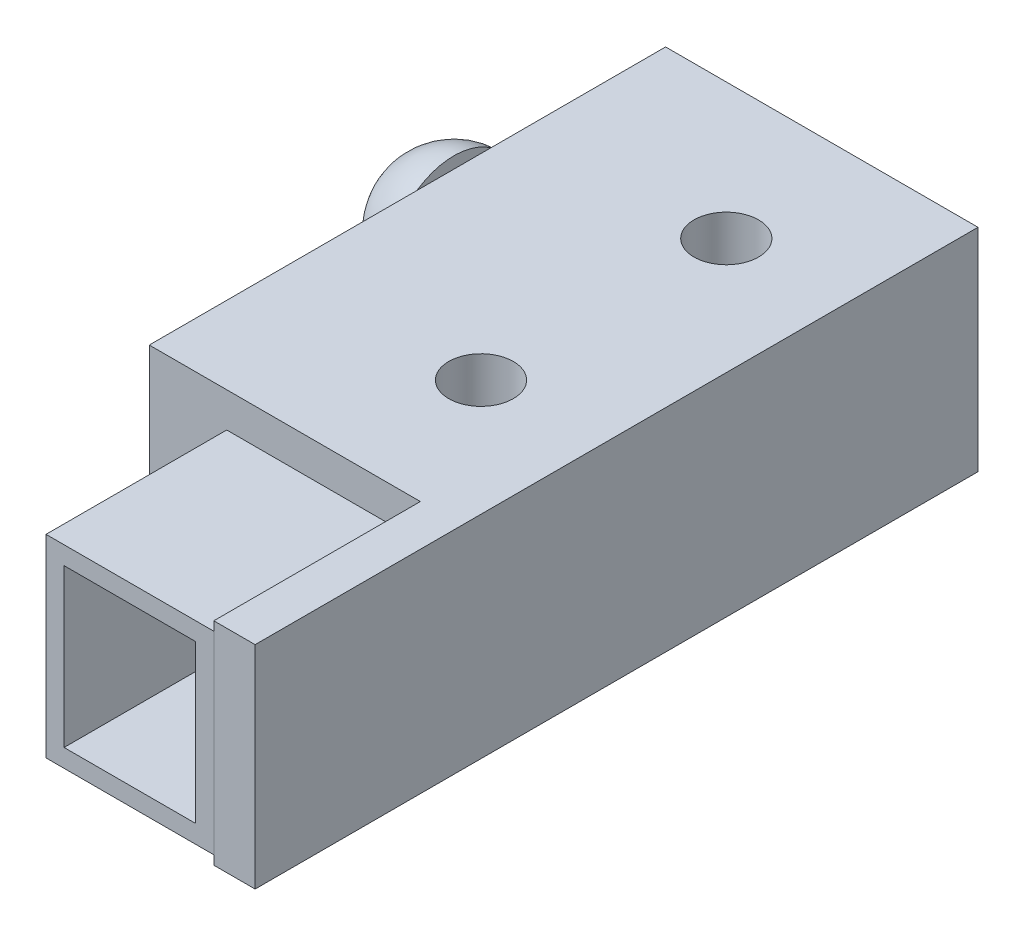
ISO-10303-21;
HEADER;
FILE_DESCRIPTION(('STEP AP214'),'2;1');
FILE_NAME('part.step','',(''),(''),'','','');
FILE_SCHEMA(('AUTOMOTIVE_DESIGN { 1 0 10303 214 1 1 1 1 }'));
ENDSEC;
DATA;
#1=APPLICATION_CONTEXT('core data for automotive mechanical design processes');
#2=APPLICATION_PROTOCOL_DEFINITION('international standard','automotive_design',2000,#1);
#3=PRODUCT_CONTEXT('',#1,'mechanical');
#4=PRODUCT('Part','Part','',(#3));
#5=PRODUCT_RELATED_PRODUCT_CATEGORY('part','',(#4));
#6=PRODUCT_DEFINITION_FORMATION('','',#4);
#7=PRODUCT_DEFINITION_CONTEXT('part definition',#1,'design');
#8=PRODUCT_DEFINITION('design','',#6,#7);
#9=PRODUCT_DEFINITION_SHAPE('','',#8);
#10=(LENGTH_UNIT() NAMED_UNIT(*) SI_UNIT(.MILLI.,.METRE.));
#11=(NAMED_UNIT(*) PLANE_ANGLE_UNIT() SI_UNIT($,.RADIAN.));
#12=(NAMED_UNIT(*) SI_UNIT($,.STERADIAN.) SOLID_ANGLE_UNIT());
#13=UNCERTAINTY_MEASURE_WITH_UNIT(LENGTH_MEASURE(1.E-05),#10,'distance_accuracy_value','');
#14=(GEOMETRIC_REPRESENTATION_CONTEXT(3) GLOBAL_UNCERTAINTY_ASSIGNED_CONTEXT((#13)) GLOBAL_UNIT_ASSIGNED_CONTEXT((#10,
#11,#12)) REPRESENTATION_CONTEXT('',''));
#15=CARTESIAN_POINT('',(0.,0.,0.));
#16=DIRECTION('',(0.,0.,1.));
#17=DIRECTION('',(1.,0.,0.));
#18=AXIS2_PLACEMENT_3D('',#15,#16,#17);
#19=CARTESIAN_POINT('',(-3.59999999999999,6.15,18.));
#20=DIRECTION('',(0.,0.,-1.));
#21=DIRECTION('',(-1.,0.,0.));
#22=AXIS2_PLACEMENT_3D('',#19,#20,#21);
#23=PLANE('',#22);
#24=DIRECTION('',(0.,1.,0.));
#25=VECTOR('',#24,1.);
#26=CARTESIAN_POINT('',(2.9,6.15,18.));
#27=LINE('',#26,#25);
#28=CARTESIAN_POINT('',(2.9,-1.35,18.));
#29=VERTEX_POINT('',#28);
#30=CARTESIAN_POINT('',(2.9,6.15,18.));
#31=VERTEX_POINT('',#30);
#32=EDGE_CURVE('E170',#29,#31,#27,.T.);
#33=ORIENTED_EDGE('',*,*,#32,.T.);
#34=DIRECTION('',(1.,0.,0.));
#35=VECTOR('',#34,1.);
#36=CARTESIAN_POINT('',(-3.59999999999999,6.15,18.));
#37=LINE('',#36,#35);
#38=CARTESIAN_POINT('',(-3.59999999999999,6.15,18.));
#39=VERTEX_POINT('',#38);
#40=EDGE_CURVE('E55',#39,#31,#37,.T.);
#41=ORIENTED_EDGE('',*,*,#40,.F.);
#42=DIRECTION('',(0.,1.,0.));
#43=VECTOR('',#42,1.);
#44=CARTESIAN_POINT('',(-3.59999999999999,6.15,18.));
#45=LINE('',#44,#43);
#46=CARTESIAN_POINT('',(-3.59999999999999,-1.35,18.));
#47=VERTEX_POINT('',#46);
#48=EDGE_CURVE('E99',#47,#39,#45,.T.);
#49=ORIENTED_EDGE('',*,*,#48,.F.);
#50=DIRECTION('',(1.,0.,0.));
#51=VECTOR('',#50,1.);
#52=CARTESIAN_POINT('',(-3.59999999999999,-1.35,18.));
#53=LINE('',#52,#51);
#54=EDGE_CURVE('E12',#47,#29,#53,.T.);
#55=ORIENTED_EDGE('',*,*,#54,.T.);
#56=EDGE_LOOP('',(#33,#41,#49,#55));
#57=FACE_BOUND('',#56,.T.);
#58=DIRECTION('',(0.,1.,0.));
#59=VECTOR('',#58,1.);
#60=CARTESIAN_POINT('',(2.20000000000001,0.,18.));
#61=LINE('',#60,#59);
#62=CARTESIAN_POINT('',(2.20000000000001,-0.650000000000003,18.));
#63=VERTEX_POINT('',#62);
#64=CARTESIAN_POINT('',(2.20000000000001,5.45,18.));
#65=VERTEX_POINT('',#64);
#66=EDGE_CURVE('E143',#63,#65,#61,.T.);
#67=ORIENTED_EDGE('',*,*,#66,.F.);
#68=DIRECTION('',(1.,0.,0.));
#69=VECTOR('',#68,1.);
#70=CARTESIAN_POINT('',(-3.59999999999999,-0.650000000000003,18.));
#71=LINE('',#70,#69);
#72=CARTESIAN_POINT('',(-2.89999999999999,-0.650000000000003,18.));
#73=VERTEX_POINT('',#72);
#74=EDGE_CURVE('E142',#73,#63,#71,.T.);
#75=ORIENTED_EDGE('',*,*,#74,.F.);
#76=DIRECTION('',(0.,1.,0.));
#77=VECTOR('',#76,1.);
#78=CARTESIAN_POINT('',(-2.89999999999999,0.,18.));
#79=LINE('',#78,#77);
#80=CARTESIAN_POINT('',(-2.89999999999999,5.45,18.));
#81=VERTEX_POINT('',#80);
#82=EDGE_CURVE('E147',#73,#81,#79,.T.);
#83=ORIENTED_EDGE('',*,*,#82,.T.);
#84=DIRECTION('',(1.,0.,0.));
#85=VECTOR('',#84,1.);
#86=CARTESIAN_POINT('',(-3.59999999999999,5.45,18.));
#87=LINE('',#86,#85);
#88=EDGE_CURVE('E152',#81,#65,#87,.T.);
#89=ORIENTED_EDGE('',*,*,#88,.T.);
#90=EDGE_LOOP('',(#67,#75,#83,#89));
#91=FACE_BOUND('',#90,.T.);
#92=ADVANCED_FACE('F47',(#57,#91),#23,.F.);
#93=CARTESIAN_POINT('',(-3.59999999999999,-1.35,18.));
#94=DIRECTION('',(0.,1.,0.));
#95=DIRECTION('',(0.,0.,1.));
#96=AXIS2_PLACEMENT_3D('',#93,#94,#95);
#97=PLANE('',#96);
#98=DIRECTION('',(0.,0.,1.));
#99=VECTOR('',#98,1.);
#100=CARTESIAN_POINT('',(2.9,-1.35,18.));
#101=LINE('',#100,#99);
#102=CARTESIAN_POINT('',(2.9,-1.35,11.));
#103=VERTEX_POINT('',#102);
#104=EDGE_CURVE('E155',#103,#29,#101,.T.);
#105=ORIENTED_EDGE('',*,*,#104,.T.);
#106=ORIENTED_EDGE('',*,*,#54,.F.);
#107=DIRECTION('',(0.,0.,1.));
#108=VECTOR('',#107,1.);
#109=CARTESIAN_POINT('',(-3.59999999999999,-1.35,18.));
#110=LINE('',#109,#108);
#111=CARTESIAN_POINT('',(-3.59999999999999,-1.35,11.));
#112=VERTEX_POINT('',#111);
#113=EDGE_CURVE('E161',#112,#47,#110,.T.);
#114=ORIENTED_EDGE('',*,*,#113,.F.);
#115=DIRECTION('',(1.,0.,0.));
#116=VECTOR('',#115,1.);
#117=CARTESIAN_POINT('',(-3.59999999999999,-1.35,11.));
#118=LINE('',#117,#116);
#119=EDGE_CURVE('E167',#112,#103,#118,.T.);
#120=ORIENTED_EDGE('',*,*,#119,.T.);
#121=EDGE_LOOP('',(#105,#106,#114,#120));
#122=FACE_BOUND('',#121,.T.);
#123=ADVANCED_FACE('F49',(#122),#97,.F.);
#124=CARTESIAN_POINT('',(-3.59999999999999,6.15,11.));
#125=DIRECTION('',(0.,-1.,0.));
#126=DIRECTION('',(0.,0.,-1.));
#127=AXIS2_PLACEMENT_3D('',#124,#125,#126);
#128=PLANE('',#127);
#129=DIRECTION('',(0.,0.,-1.));
#130=VECTOR('',#129,1.);
#131=CARTESIAN_POINT('',(2.9,6.15,11.));
#132=LINE('',#131,#130);
#133=CARTESIAN_POINT('',(2.9,6.15,11.));
#134=VERTEX_POINT('',#133);
#135=EDGE_CURVE('E172',#31,#134,#132,.T.);
#136=ORIENTED_EDGE('',*,*,#135,.T.);
#137=DIRECTION('',(1.,0.,0.));
#138=VECTOR('',#137,1.);
#139=CARTESIAN_POINT('',(-3.59999999999999,6.15,11.));
#140=LINE('',#139,#138);
#141=CARTESIAN_POINT('',(-3.59999999999999,6.15,11.));
#142=VERTEX_POINT('',#141);
#143=EDGE_CURVE('E176',#142,#134,#140,.T.);
#144=ORIENTED_EDGE('',*,*,#143,.F.);
#145=DIRECTION('',(0.,0.,-1.));
#146=VECTOR('',#145,1.);
#147=CARTESIAN_POINT('',(-3.59999999999999,6.15,11.));
#148=LINE('',#147,#146);
#149=EDGE_CURVE('E164',#39,#142,#148,.T.);
#150=ORIENTED_EDGE('',*,*,#149,.F.);
#151=ORIENTED_EDGE('',*,*,#40,.T.);
#152=EDGE_LOOP('',(#136,#144,#150,#151));
#153=FACE_BOUND('',#152,.T.);
#154=ADVANCED_FACE('F181',(#153),#128,.F.);
#155=CARTESIAN_POINT('',(-3.59999999999999,-1.35,11.));
#156=DIRECTION('',(0.,0.,1.));
#157=DIRECTION('',(1.,0.,0.));
#158=AXIS2_PLACEMENT_3D('',#155,#156,#157);
#159=PLANE('',#158);
#160=DIRECTION('',(0.,-1.,0.));
#161=VECTOR('',#160,1.);
#162=CARTESIAN_POINT('',(2.9,-1.35,11.));
#163=LINE('',#162,#161);
#164=EDGE_CURVE('E92',#134,#103,#163,.T.);
#165=ORIENTED_EDGE('',*,*,#164,.T.);
#166=ORIENTED_EDGE('',*,*,#119,.F.);
#167=DIRECTION('',(0.,-1.,0.));
#168=VECTOR('',#167,1.);
#169=CARTESIAN_POINT('',(-3.59999999999999,-1.35,11.));
#170=LINE('',#169,#168);
#171=EDGE_CURVE('E71',#142,#112,#170,.T.);
#172=ORIENTED_EDGE('',*,*,#171,.F.);
#173=ORIENTED_EDGE('',*,*,#143,.T.);
#174=EDGE_LOOP('',(#165,#166,#172,#173));
#175=FACE_BOUND('',#174,.T.);
#176=ADVANCED_FACE('F189',(#175),#159,.F.);
#177=CARTESIAN_POINT('',(-3.59999999999999,0.,0.));
#178=DIRECTION('',(1.,0.,0.));
#179=DIRECTION('',(0.,0.,-1.));
#180=AXIS2_PLACEMENT_3D('',#177,#178,#179);
#181=PLANE('',#180);
#182=ORIENTED_EDGE('',*,*,#113,.T.);
#183=ORIENTED_EDGE('',*,*,#48,.T.);
#184=ORIENTED_EDGE('',*,*,#149,.T.);
#185=ORIENTED_EDGE('',*,*,#171,.T.);
#186=EDGE_LOOP('',(#182,#183,#184,#185));
#187=FACE_BOUND('',#186,.T.);
#188=ADVANCED_FACE('F191',(#187),#181,.F.);
#189=CARTESIAN_POINT('',(2.9,0.,0.));
#190=DIRECTION('',(1.,0.,0.));
#191=DIRECTION('',(0.,0.,-1.));
#192=AXIS2_PLACEMENT_3D('',#189,#190,#191);
#193=PLANE('',#192);
#194=ORIENTED_EDGE('',*,*,#104,.F.);
#195=ORIENTED_EDGE('',*,*,#164,.F.);
#196=ORIENTED_EDGE('',*,*,#135,.F.);
#197=ORIENTED_EDGE('',*,*,#32,.F.);
#198=EDGE_LOOP('',(#194,#195,#196,#197));
#199=FACE_BOUND('',#198,.T.);
#200=ADVANCED_FACE('F185',(#199),#193,.T.);
#201=CARTESIAN_POINT('',(-3.59999999999999,-0.650000000000003,18.));
#202=DIRECTION('',(0.,1.,0.));
#203=DIRECTION('',(0.,0.,1.));
#204=AXIS2_PLACEMENT_3D('',#201,#202,#203);
#205=PLANE('',#204);
#206=DIRECTION('',(0.,0.,1.));
#207=VECTOR('',#206,1.);
#208=CARTESIAN_POINT('',(2.20000000000001,-0.650000000000003,0.));
#209=LINE('',#208,#207);
#210=CARTESIAN_POINT('',(2.20000000000001,-0.650000000000003,11.7));
#211=VERTEX_POINT('',#210);
#212=EDGE_CURVE('E126',#211,#63,#209,.T.);
#213=ORIENTED_EDGE('',*,*,#212,.F.);
#214=DIRECTION('',(1.,0.,0.));
#215=VECTOR('',#214,1.);
#216=CARTESIAN_POINT('',(-3.59999999999999,-0.650000000000003,11.7));
#217=LINE('',#216,#215);
#218=CARTESIAN_POINT('',(-2.89999999999999,-0.650000000000003,11.7));
#219=VERTEX_POINT('',#218);
#220=EDGE_CURVE('E134',#219,#211,#217,.T.);
#221=ORIENTED_EDGE('',*,*,#220,.F.);
#222=DIRECTION('',(0.,0.,1.));
#223=VECTOR('',#222,1.);
#224=CARTESIAN_POINT('',(-2.89999999999999,-0.650000000000003,0.));
#225=LINE('',#224,#223);
#226=EDGE_CURVE('E62',#219,#73,#225,.T.);
#227=ORIENTED_EDGE('',*,*,#226,.T.);
#228=ORIENTED_EDGE('',*,*,#74,.T.);
#229=EDGE_LOOP('',(#213,#221,#227,#228));
#230=FACE_BOUND('',#229,.T.);
#231=ADVANCED_FACE('F140',(#230),#205,.T.);
#232=CARTESIAN_POINT('',(-3.59999999999999,5.45,11.));
#233=DIRECTION('',(0.,-1.,0.));
#234=DIRECTION('',(0.,0.,-1.));
#235=AXIS2_PLACEMENT_3D('',#232,#233,#234);
#236=PLANE('',#235);
#237=DIRECTION('',(0.,0.,-1.));
#238=VECTOR('',#237,1.);
#239=CARTESIAN_POINT('',(2.20000000000001,5.45,0.));
#240=LINE('',#239,#238);
#241=CARTESIAN_POINT('',(2.20000000000001,5.45,11.7));
#242=VERTEX_POINT('',#241);
#243=EDGE_CURVE('E129',#65,#242,#240,.T.);
#244=ORIENTED_EDGE('',*,*,#243,.F.);
#245=ORIENTED_EDGE('',*,*,#88,.F.);
#246=DIRECTION('',(0.,0.,-1.));
#247=VECTOR('',#246,1.);
#248=CARTESIAN_POINT('',(-2.89999999999999,5.45,0.));
#249=LINE('',#248,#247);
#250=CARTESIAN_POINT('',(-2.89999999999999,5.45,11.7));
#251=VERTEX_POINT('',#250);
#252=EDGE_CURVE('E150',#81,#251,#249,.T.);
#253=ORIENTED_EDGE('',*,*,#252,.T.);
#254=DIRECTION('',(1.,0.,0.));
#255=VECTOR('',#254,1.);
#256=CARTESIAN_POINT('',(-3.59999999999999,5.45,11.7));
#257=LINE('',#256,#255);
#258=EDGE_CURVE('E138',#251,#242,#257,.T.);
#259=ORIENTED_EDGE('',*,*,#258,.T.);
#260=EDGE_LOOP('',(#244,#245,#253,#259));
#261=FACE_BOUND('',#260,.T.);
#262=ADVANCED_FACE('F206',(#261),#236,.T.);
#263=CARTESIAN_POINT('',(-3.59999999999999,-1.35,11.7));
#264=DIRECTION('',(0.,0.,1.));
#265=DIRECTION('',(1.,0.,0.));
#266=AXIS2_PLACEMENT_3D('',#263,#264,#265);
#267=PLANE('',#266);
#268=DIRECTION('',(0.,-1.,0.));
#269=VECTOR('',#268,1.);
#270=CARTESIAN_POINT('',(2.20000000000001,0.,11.7));
#271=LINE('',#270,#269);
#272=EDGE_CURVE('E122',#242,#211,#271,.T.);
#273=ORIENTED_EDGE('',*,*,#272,.F.);
#274=ORIENTED_EDGE('',*,*,#258,.F.);
#275=DIRECTION('',(0.,-1.,0.));
#276=VECTOR('',#275,1.);
#277=CARTESIAN_POINT('',(-2.89999999999999,0.,11.7));
#278=LINE('',#277,#276);
#279=EDGE_CURVE('E137',#251,#219,#278,.T.);
#280=ORIENTED_EDGE('',*,*,#279,.T.);
#281=ORIENTED_EDGE('',*,*,#220,.T.);
#282=EDGE_LOOP('',(#273,#274,#280,#281));
#283=FACE_BOUND('',#282,.T.);
#284=ADVANCED_FACE('F135',(#283),#267,.T.);
#285=CARTESIAN_POINT('',(-2.89999999999999,0.,0.));
#286=DIRECTION('',(1.,0.,0.));
#287=DIRECTION('',(0.,0.,-1.));
#288=AXIS2_PLACEMENT_3D('',#285,#286,#287);
#289=PLANE('',#288);
#290=ORIENTED_EDGE('',*,*,#226,.F.);
#291=ORIENTED_EDGE('',*,*,#279,.F.);
#292=ORIENTED_EDGE('',*,*,#252,.F.);
#293=ORIENTED_EDGE('',*,*,#82,.F.);
#294=EDGE_LOOP('',(#290,#291,#292,#293));
#295=FACE_BOUND('',#294,.T.);
#296=ADVANCED_FACE('F209',(#295),#289,.T.);
#297=CARTESIAN_POINT('',(2.20000000000001,0.,0.));
#298=DIRECTION('',(1.,0.,0.));
#299=DIRECTION('',(0.,0.,-1.));
#300=AXIS2_PLACEMENT_3D('',#297,#298,#299);
#301=PLANE('',#300);
#302=ORIENTED_EDGE('',*,*,#212,.T.);
#303=ORIENTED_EDGE('',*,*,#66,.T.);
#304=ORIENTED_EDGE('',*,*,#243,.T.);
#305=ORIENTED_EDGE('',*,*,#272,.T.);
#306=EDGE_LOOP('',(#302,#303,#304,#305));
#307=FACE_BOUND('',#306,.T.);
#308=ADVANCED_FACE('F124',(#307),#301,.F.);
#309=CLOSED_SHELL('',(#92,#123,#154,#176,#188,#200,#231,#262,#284,#296,#308));
#310=MANIFOLD_SOLID_BREP('B2',#309);
#311=CARTESIAN_POINT('',(-7.6,6.5,10.));
#312=DIRECTION('',(1.,0.,0.));
#313=DIRECTION('',(0.,0.,-1.));
#314=AXIS2_PLACEMENT_3D('',#311,#312,#313);
#315=PLANE('',#314);
#316=DIRECTION('',(0.,0.,1.));
#317=VECTOR('',#316,1.);
#318=CARTESIAN_POINT('',(-7.6,0.,10.));
#319=LINE('',#318,#317);
#320=CARTESIAN_POINT('',(-7.6,0.,-10.));
#321=VERTEX_POINT('',#320);
#322=CARTESIAN_POINT('',(-7.6,0.,10.));
#323=VERTEX_POINT('',#322);
#324=EDGE_CURVE('E459',#321,#323,#319,.T.);
#325=ORIENTED_EDGE('',*,*,#324,.T.);
#326=DIRECTION('',(0.,-1.,0.));
#327=VECTOR('',#326,1.);
#328=CARTESIAN_POINT('',(-7.6,6.5,10.));
#329=LINE('',#328,#327);
#330=CARTESIAN_POINT('',(-7.6,6.5,10.));
#331=VERTEX_POINT('',#330);
#332=EDGE_CURVE('E462',#331,#323,#329,.T.);
#333=ORIENTED_EDGE('',*,*,#332,.F.);
#334=DIRECTION('',(0.,0.,1.));
#335=VECTOR('',#334,1.);
#336=CARTESIAN_POINT('',(-7.6,6.5,10.));
#337=LINE('',#336,#335);
#338=CARTESIAN_POINT('',(-7.6,6.5,-10.));
#339=VERTEX_POINT('',#338);
#340=EDGE_CURVE('E376',#339,#331,#337,.T.);
#341=ORIENTED_EDGE('',*,*,#340,.F.);
#342=DIRECTION('',(0.,-1.,0.));
#343=VECTOR('',#342,1.);
#344=CARTESIAN_POINT('',(-7.6,6.5,-10.));
#345=LINE('',#344,#343);
#346=EDGE_CURVE('E294',#339,#321,#345,.T.);
#347=ORIENTED_EDGE('',*,*,#346,.T.);
#348=EDGE_LOOP('',(#325,#333,#341,#347));
#349=FACE_BOUND('',#348,.T.);
#350=DIRECTION('',(0.,1.,0.));
#351=VECTOR('',#350,1.);
#352=CARTESIAN_POINT('',(-7.6,1.5,-2.));
#353=LINE('',#352,#351);
#354=CARTESIAN_POINT('',(-7.6,1.5,-2.));
#355=VERTEX_POINT('',#354);
#356=CARTESIAN_POINT('',(-7.6,5.,-2.));
#357=VERTEX_POINT('',#356);
#358=EDGE_CURVE('E415',#355,#357,#353,.T.);
#359=ORIENTED_EDGE('',*,*,#358,.F.);
#360=DIRECTION('',(0.,0.,1.));
#361=VECTOR('',#360,1.);
#362=CARTESIAN_POINT('',(-7.6,1.5,-4.));
#363=LINE('',#362,#361);
#364=CARTESIAN_POINT('',(-7.6,1.5,-4.));
#365=VERTEX_POINT('',#364);
#366=EDGE_CURVE('E420',#365,#355,#363,.T.);
#367=ORIENTED_EDGE('',*,*,#366,.F.);
#368=DIRECTION('',(0.,-1.,0.));
#369=VECTOR('',#368,1.);
#370=CARTESIAN_POINT('',(-7.6,1.5,-4.));
#371=LINE('',#370,#369);
#372=CARTESIAN_POINT('',(-7.6,5.,-4.));
#373=VERTEX_POINT('',#372);
#374=EDGE_CURVE('E306',#373,#365,#371,.T.);
#375=ORIENTED_EDGE('',*,*,#374,.F.);
#376=DIRECTION('',(0.,0.,-1.));
#377=VECTOR('',#376,1.);
#378=CARTESIAN_POINT('',(-7.6,5.,-4.));
#379=LINE('',#378,#377);
#380=EDGE_CURVE('E301',#357,#373,#379,.T.);
#381=ORIENTED_EDGE('',*,*,#380,.F.);
#382=EDGE_LOOP('',(#359,#367,#375,#381));
#383=FACE_BOUND('',#382,.T.);
#384=ADVANCED_FACE('F286',(#349,#383),#315,.F.);
#385=CARTESIAN_POINT('',(0.,6.5,0.));
#386=DIRECTION('',(0.,-1.,0.));
#387=DIRECTION('',(0.,0.,-1.));
#388=AXIS2_PLACEMENT_3D('',#385,#386,#387);
#389=PLANE('',#388);
#390=DIRECTION('',(1.,0.,0.));
#391=VECTOR('',#390,1.);
#392=CARTESIAN_POINT('',(2.9,6.5,10.));
#393=LINE('',#392,#391);
#394=CARTESIAN_POINT('',(2.9,6.5,10.));
#395=VERTEX_POINT('',#394);
#396=EDGE_CURVE('E377',#331,#395,#393,.T.);
#397=ORIENTED_EDGE('',*,*,#396,.T.);
#398=DIRECTION('',(0.,0.,1.));
#399=VECTOR('',#398,1.);
#400=CARTESIAN_POINT('',(2.9,6.5,-10.));
#401=LINE('',#400,#399);
#402=CARTESIAN_POINT('',(2.9,6.5,18.));
#403=VERTEX_POINT('',#402);
#404=EDGE_CURVE('E404',#395,#403,#401,.T.);
#405=ORIENTED_EDGE('',*,*,#404,.T.);
#406=DIRECTION('',(-1.,0.,0.));
#407=VECTOR('',#406,1.);
#408=CARTESIAN_POINT('',(4.5,6.5,18.));
#409=LINE('',#408,#407);
#410=CARTESIAN_POINT('',(4.5,6.5,18.));
#411=VERTEX_POINT('',#410);
#412=EDGE_CURVE('E384',#411,#403,#409,.T.);
#413=ORIENTED_EDGE('',*,*,#412,.F.);
#414=DIRECTION('',(0.,0.,1.));
#415=VECTOR('',#414,1.);
#416=CARTESIAN_POINT('',(4.5,6.5,-10.));
#417=LINE('',#416,#415);
#418=CARTESIAN_POINT('',(4.5,6.5,-10.));
#419=VERTEX_POINT('',#418);
#420=EDGE_CURVE('E380',#419,#411,#417,.T.);
#421=ORIENTED_EDGE('',*,*,#420,.F.);
#422=DIRECTION('',(-1.,0.,0.));
#423=VECTOR('',#422,1.);
#424=CARTESIAN_POINT('',(-7.6,6.5,-10.));
#425=LINE('',#424,#423);
#426=EDGE_CURVE('E367',#419,#339,#425,.T.);
#427=ORIENTED_EDGE('',*,*,#426,.T.);
#428=ORIENTED_EDGE('',*,*,#340,.T.);
#429=EDGE_LOOP('',(#397,#405,#413,#421,#427,#428));
#430=FACE_BOUND('',#429,.T.);
#431=CARTESIAN_POINT('',(0.,6.5,-4.75));
#432=DIRECTION('',(0.,1.,0.));
#433=DIRECTION('',(0.,0.,1.));
#434=AXIS2_PLACEMENT_3D('',#431,#432,#433);
#435=CIRCLE('',#434,1.25);
#436=CARTESIAN_POINT('',(0.,6.5,-6.));
#437=VERTEX_POINT('',#436);
#438=EDGE_CURVE('E453',#437,#437,#435,.T.);
#439=ORIENTED_EDGE('',*,*,#438,.F.);
#440=EDGE_LOOP('',(#439));
#441=FACE_BOUND('',#440,.T.);
#442=CARTESIAN_POINT('',(0.,6.5,4.75));
#443=DIRECTION('',(0.,1.,0.));
#444=DIRECTION('',(0.,0.,1.));
#445=AXIS2_PLACEMENT_3D('',#442,#443,#444);
#446=CIRCLE('',#445,1.25);
#447=CARTESIAN_POINT('',(0.,6.5,3.5));
#448=VERTEX_POINT('',#447);
#449=EDGE_CURVE('E447',#448,#448,#446,.T.);
#450=ORIENTED_EDGE('',*,*,#449,.F.);
#451=EDGE_LOOP('',(#450));
#452=FACE_BOUND('',#451,.T.);
#453=ADVANCED_FACE('F381',(#430,#441,#452),#389,.F.);
#454=CARTESIAN_POINT('',(0.,0.,0.));
#455=DIRECTION('',(0.,-1.,0.));
#456=DIRECTION('',(0.,0.,-1.));
#457=AXIS2_PLACEMENT_3D('',#454,#455,#456);
#458=PLANE('',#457);
#459=CARTESIAN_POINT('',(0.,0.,-4.75));
#460=DIRECTION('',(0.,1.,0.));
#461=DIRECTION('',(0.,0.,1.));
#462=AXIS2_PLACEMENT_3D('',#459,#460,#461);
#463=CIRCLE('',#462,1.25);
#464=CARTESIAN_POINT('',(0.,0.,-6.));
#465=VERTEX_POINT('',#464);
#466=EDGE_CURVE('E450',#465,#465,#463,.T.);
#467=ORIENTED_EDGE('',*,*,#466,.T.);
#468=EDGE_LOOP('',(#467));
#469=FACE_BOUND('',#468,.T.);
#470=DIRECTION('',(1.,0.,0.));
#471=VECTOR('',#470,1.);
#472=CARTESIAN_POINT('',(2.9,0.,10.));
#473=LINE('',#472,#471);
#474=CARTESIAN_POINT('',(2.9,0.,10.));
#475=VERTEX_POINT('',#474);
#476=EDGE_CURVE('E456',#323,#475,#473,.T.);
#477=ORIENTED_EDGE('',*,*,#476,.F.);
#478=ORIENTED_EDGE('',*,*,#324,.F.);
#479=DIRECTION('',(-1.,0.,0.));
#480=VECTOR('',#479,1.);
#481=CARTESIAN_POINT('',(-7.6,0.,-10.));
#482=LINE('',#481,#480);
#483=CARTESIAN_POINT('',(2.9,0.,-10.));
#484=VERTEX_POINT('',#483);
#485=EDGE_CURVE('E467',#484,#321,#482,.T.);
#486=ORIENTED_EDGE('',*,*,#485,.F.);
#487=DIRECTION('',(0.,0.,-1.));
#488=VECTOR('',#487,1.);
#489=CARTESIAN_POINT('',(2.9,0.,-10.));
#490=LINE('',#489,#488);
#491=EDGE_CURVE('E464',#475,#484,#490,.T.);
#492=ORIENTED_EDGE('',*,*,#491,.F.);
#493=EDGE_LOOP('',(#477,#478,#486,#492));
#494=FACE_BOUND('',#493,.T.);
#495=CARTESIAN_POINT('',(0.,0.,4.75));
#496=DIRECTION('',(0.,1.,0.));
#497=DIRECTION('',(0.,0.,1.));
#498=AXIS2_PLACEMENT_3D('',#495,#496,#497);
#499=CIRCLE('',#498,1.25);
#500=CARTESIAN_POINT('',(0.,0.,3.5));
#501=VERTEX_POINT('',#500);
#502=EDGE_CURVE('E446',#501,#501,#499,.T.);
#503=ORIENTED_EDGE('',*,*,#502,.T.);
#504=EDGE_LOOP('',(#503));
#505=FACE_BOUND('',#504,.T.);
#506=ADVANCED_FACE('F476',(#469,#494,#505),#458,.T.);
#507=CARTESIAN_POINT('',(2.9,6.5,10.));
#508=DIRECTION('',(0.,0.,-1.));
#509=DIRECTION('',(-1.,0.,0.));
#510=AXIS2_PLACEMENT_3D('',#507,#508,#509);
#511=PLANE('',#510);
#512=ORIENTED_EDGE('',*,*,#476,.T.);
#513=DIRECTION('',(0.,-1.,0.));
#514=VECTOR('',#513,1.);
#515=CARTESIAN_POINT('',(2.9,6.5,10.));
#516=LINE('',#515,#514);
#517=EDGE_CURVE('E45',#395,#475,#516,.T.);
#518=ORIENTED_EDGE('',*,*,#517,.F.);
#519=ORIENTED_EDGE('',*,*,#396,.F.);
#520=ORIENTED_EDGE('',*,*,#332,.T.);
#521=EDGE_LOOP('',(#512,#518,#519,#520));
#522=FACE_BOUND('',#521,.T.);
#523=ADVANCED_FACE('F481',(#522),#511,.F.);
#524=CARTESIAN_POINT('',(-7.6,6.5,-10.));
#525=DIRECTION('',(0.,0.,1.));
#526=DIRECTION('',(1.,0.,0.));
#527=AXIS2_PLACEMENT_3D('',#524,#525,#526);
#528=PLANE('',#527);
#529=ORIENTED_EDGE('',*,*,#485,.T.);
#530=ORIENTED_EDGE('',*,*,#346,.F.);
#531=ORIENTED_EDGE('',*,*,#426,.F.);
#532=DIRECTION('',(0.,1.,0.));
#533=VECTOR('',#532,1.);
#534=CARTESIAN_POINT('',(4.5,-1.7,-10.));
#535=LINE('',#534,#533);
#536=CARTESIAN_POINT('',(4.5,-1.7,-10.));
#537=VERTEX_POINT('',#536);
#538=EDGE_CURVE('E372',#537,#419,#535,.T.);
#539=ORIENTED_EDGE('',*,*,#538,.F.);
#540=DIRECTION('',(-1.,0.,0.));
#541=VECTOR('',#540,1.);
#542=CARTESIAN_POINT('',(4.5,-1.7,-10.));
#543=LINE('',#542,#541);
#544=CARTESIAN_POINT('',(2.9,-1.7,-10.));
#545=VERTEX_POINT('',#544);
#546=EDGE_CURVE('E400',#537,#545,#543,.T.);
#547=ORIENTED_EDGE('',*,*,#546,.T.);
#548=DIRECTION('',(0.,1.,0.));
#549=VECTOR('',#548,1.);
#550=CARTESIAN_POINT('',(2.9,-1.7,-10.));
#551=LINE('',#550,#549);
#552=EDGE_CURVE('E401',#545,#484,#551,.T.);
#553=ORIENTED_EDGE('',*,*,#552,.T.);
#554=EDGE_LOOP('',(#529,#530,#531,#539,#547,#553));
#555=FACE_BOUND('',#554,.T.);
#556=ADVANCED_FACE('F369',(#555),#528,.F.);
#557=CARTESIAN_POINT('',(0.,6.5,-4.75));
#558=DIRECTION('',(0.,-1.,0.));
#559=DIRECTION('',(0.,0.,-1.));
#560=AXIS2_PLACEMENT_3D('',#557,#558,#559);
#561=CYLINDRICAL_SURFACE('',#560,1.25);
#562=CARTESIAN_POINT('',(0.,6.5,-6.));
#563=CARTESIAN_POINT('',(0.,6.43229166666667,-6.));
#564=CARTESIAN_POINT('',(0.,6.36458333333333,-6.));
#565=CARTESIAN_POINT('',(0.,6.22916666666667,-6.));
#566=CARTESIAN_POINT('',(0.,6.16145833333333,-6.));
#567=CARTESIAN_POINT('',(0.,6.02604166666667,-6.));
#568=CARTESIAN_POINT('',(0.,5.95833333333333,-6.));
#569=CARTESIAN_POINT('',(0.,5.82291666666667,-6.));
#570=CARTESIAN_POINT('',(0.,5.75520833333333,-6.));
#571=CARTESIAN_POINT('',(0.,5.61979166666667,-6.));
#572=CARTESIAN_POINT('',(0.,5.55208333333333,-6.));
#573=CARTESIAN_POINT('',(0.,5.41666666666667,-6.));
#574=CARTESIAN_POINT('',(0.,5.34895833333333,-6.));
#575=CARTESIAN_POINT('',(0.,5.21354166666667,-6.));
#576=CARTESIAN_POINT('',(0.,5.14583333333333,-6.));
#577=CARTESIAN_POINT('',(0.,5.01041666666667,-6.));
#578=CARTESIAN_POINT('',(0.,4.94270833333333,-6.));
#579=CARTESIAN_POINT('',(0.,4.80729166666667,-6.));
#580=CARTESIAN_POINT('',(0.,4.73958333333333,-6.));
#581=CARTESIAN_POINT('',(0.,4.60416666666667,-6.));
#582=CARTESIAN_POINT('',(0.,4.53645833333333,-6.));
#583=CARTESIAN_POINT('',(0.,4.40104166666667,-6.));
#584=CARTESIAN_POINT('',(0.,4.33333333333333,-6.));
#585=CARTESIAN_POINT('',(0.,4.19791666666667,-6.));
#586=CARTESIAN_POINT('',(0.,4.13020833333333,-6.));
#587=CARTESIAN_POINT('',(0.,3.99479166666667,-6.));
#588=CARTESIAN_POINT('',(0.,3.92708333333333,-6.));
#589=CARTESIAN_POINT('',(0.,3.79166666666667,-6.));
#590=CARTESIAN_POINT('',(0.,3.72395833333333,-6.));
#591=CARTESIAN_POINT('',(0.,3.58854166666667,-6.));
#592=CARTESIAN_POINT('',(0.,3.52083333333333,-6.));
#593=CARTESIAN_POINT('',(0.,3.38541666666667,-6.));
#594=CARTESIAN_POINT('',(0.,3.31770833333333,-6.));
#595=CARTESIAN_POINT('',(0.,3.18229166666667,-6.));
#596=CARTESIAN_POINT('',(0.,3.11458333333333,-6.));
#597=CARTESIAN_POINT('',(0.,2.97916666666667,-6.));
#598=CARTESIAN_POINT('',(0.,2.91145833333333,-6.));
#599=CARTESIAN_POINT('',(0.,2.77604166666667,-6.));
#600=CARTESIAN_POINT('',(0.,2.70833333333333,-6.));
#601=CARTESIAN_POINT('',(0.,2.57291666666667,-6.));
#602=CARTESIAN_POINT('',(0.,2.50520833333333,-6.));
#603=CARTESIAN_POINT('',(0.,2.36979166666667,-6.));
#604=CARTESIAN_POINT('',(0.,2.30208333333333,-6.));
#605=CARTESIAN_POINT('',(0.,2.16666666666667,-6.));
#606=CARTESIAN_POINT('',(0.,2.09895833333333,-6.));
#607=CARTESIAN_POINT('',(0.,1.96354166666667,-6.));
#608=CARTESIAN_POINT('',(0.,1.89583333333333,-6.));
#609=CARTESIAN_POINT('',(0.,1.76041666666667,-6.));
#610=CARTESIAN_POINT('',(0.,1.69270833333333,-6.));
#611=CARTESIAN_POINT('',(0.,1.55729166666667,-6.));
#612=CARTESIAN_POINT('',(0.,1.48958333333333,-6.));
#613=CARTESIAN_POINT('',(0.,1.35416666666667,-6.));
#614=CARTESIAN_POINT('',(0.,1.28645833333333,-6.));
#615=CARTESIAN_POINT('',(0.,1.15104166666667,-6.));
#616=CARTESIAN_POINT('',(0.,1.08333333333333,-6.));
#617=CARTESIAN_POINT('',(0.,0.947916666666667,-6.));
#618=CARTESIAN_POINT('',(0.,0.880208333333333,-6.));
#619=CARTESIAN_POINT('',(0.,0.744791666666667,-6.));
#620=CARTESIAN_POINT('',(0.,0.677083333333333,-6.));
#621=CARTESIAN_POINT('',(0.,0.541666666666667,-6.));
#622=CARTESIAN_POINT('',(0.,0.473958333333333,-6.));
#623=CARTESIAN_POINT('',(0.,0.338541666666667,-6.));
#624=CARTESIAN_POINT('',(0.,0.270833333333334,-6.));
#625=CARTESIAN_POINT('',(0.,0.135416666666667,-6.));
#626=CARTESIAN_POINT('',(0.,0.0677083333333334,-6.));
#627=CARTESIAN_POINT('',(0.,0.,-6.));
#628=B_SPLINE_CURVE_WITH_KNOTS('',3,(#562,#563,#564,#565,#566,#567,#568,#569,#570,#571,#572,
#573,#574,#575,#576,#577,#578,#579,#580,#581,#582,#583,#584,#585,#586,#587,#588,#589,#590,#591,
#592,#593,#594,#595,#596,#597,#598,#599,#600,#601,#602,#603,#604,#605,#606,#607,#608,#609,#610,
#611,#612,#613,#614,#615,#616,#617,#618,#619,#620,#621,#622,#623,#624,#625,#626,#627),
.UNSPECIFIED.,.F.,.F.,(4,2,2,2,2,2,2,2,2,2,2,2,2,2,2,2,2,2,2,2,2,2,2,2,2,2,2,2,2,2,2,2,4),(0.,
0.203124999999999,0.40625,0.609375,0.812499999999999,1.015625,1.21875,1.421875,1.625,1.828125,
2.03125,2.234375,2.4375,2.640625,2.84375,3.046875,3.25,3.453125,3.65625,3.859375,4.0625,
4.265625,4.46875,4.671875,4.875,5.078125,5.28125,5.484375,5.6875,5.890625,6.09375,6.296875,6.5),.UNSPECIFIED.);
#629=EDGE_CURVE('BSEAM512',#437,#465,#628,.T.);
#630=ORIENTED_EDGE('',*,*,#438,.T.);
#631=ORIENTED_EDGE('',*,*,#466,.F.);
#632=ORIENTED_EDGE('',*,*,#629,.T.);
#633=ORIENTED_EDGE('',*,*,#629,.F.);
#634=EDGE_LOOP('',(#630,#632,#631,#633));
#635=FACE_BOUND('',#634,.T.);
#636=ADVANCED_FACE('F512',(#635),#561,.F.);
#637=CARTESIAN_POINT('',(0.,6.5,4.75));
#638=DIRECTION('',(0.,-1.,0.));
#639=DIRECTION('',(0.,0.,-1.));
#640=AXIS2_PLACEMENT_3D('',#637,#638,#639);
#641=CYLINDRICAL_SURFACE('',#640,1.25);
#642=CARTESIAN_POINT('',(0.,6.5,3.5));
#643=CARTESIAN_POINT('',(0.,6.43229166666667,3.5));
#644=CARTESIAN_POINT('',(0.,6.36458333333333,3.5));
#645=CARTESIAN_POINT('',(0.,6.22916666666667,3.5));
#646=CARTESIAN_POINT('',(0.,6.16145833333333,3.5));
#647=CARTESIAN_POINT('',(0.,6.02604166666667,3.5));
#648=CARTESIAN_POINT('',(0.,5.95833333333333,3.5));
#649=CARTESIAN_POINT('',(0.,5.82291666666667,3.5));
#650=CARTESIAN_POINT('',(0.,5.75520833333333,3.5));
#651=CARTESIAN_POINT('',(0.,5.61979166666667,3.5));
#652=CARTESIAN_POINT('',(0.,5.55208333333333,3.5));
#653=CARTESIAN_POINT('',(0.,5.41666666666667,3.5));
#654=CARTESIAN_POINT('',(0.,5.34895833333333,3.5));
#655=CARTESIAN_POINT('',(0.,5.21354166666667,3.5));
#656=CARTESIAN_POINT('',(0.,5.14583333333333,3.5));
#657=CARTESIAN_POINT('',(0.,5.01041666666667,3.5));
#658=CARTESIAN_POINT('',(0.,4.94270833333333,3.5));
#659=CARTESIAN_POINT('',(0.,4.80729166666667,3.5));
#660=CARTESIAN_POINT('',(0.,4.73958333333333,3.5));
#661=CARTESIAN_POINT('',(0.,4.60416666666667,3.5));
#662=CARTESIAN_POINT('',(0.,4.53645833333333,3.5));
#663=CARTESIAN_POINT('',(0.,4.40104166666667,3.5));
#664=CARTESIAN_POINT('',(0.,4.33333333333333,3.5));
#665=CARTESIAN_POINT('',(0.,4.19791666666667,3.5));
#666=CARTESIAN_POINT('',(0.,4.13020833333333,3.5));
#667=CARTESIAN_POINT('',(0.,3.99479166666667,3.5));
#668=CARTESIAN_POINT('',(0.,3.92708333333333,3.5));
#669=CARTESIAN_POINT('',(0.,3.79166666666667,3.5));
#670=CARTESIAN_POINT('',(0.,3.72395833333333,3.5));
#671=CARTESIAN_POINT('',(0.,3.58854166666667,3.5));
#672=CARTESIAN_POINT('',(0.,3.52083333333333,3.5));
#673=CARTESIAN_POINT('',(0.,3.38541666666667,3.5));
#674=CARTESIAN_POINT('',(0.,3.31770833333333,3.5));
#675=CARTESIAN_POINT('',(0.,3.18229166666667,3.5));
#676=CARTESIAN_POINT('',(0.,3.11458333333333,3.5));
#677=CARTESIAN_POINT('',(0.,2.97916666666667,3.5));
#678=CARTESIAN_POINT('',(0.,2.91145833333333,3.5));
#679=CARTESIAN_POINT('',(0.,2.77604166666667,3.5));
#680=CARTESIAN_POINT('',(0.,2.70833333333333,3.5));
#681=CARTESIAN_POINT('',(0.,2.57291666666667,3.5));
#682=CARTESIAN_POINT('',(0.,2.50520833333333,3.5));
#683=CARTESIAN_POINT('',(0.,2.36979166666667,3.5));
#684=CARTESIAN_POINT('',(0.,2.30208333333333,3.5));
#685=CARTESIAN_POINT('',(0.,2.16666666666667,3.5));
#686=CARTESIAN_POINT('',(0.,2.09895833333333,3.5));
#687=CARTESIAN_POINT('',(0.,1.96354166666667,3.5));
#688=CARTESIAN_POINT('',(0.,1.89583333333333,3.5));
#689=CARTESIAN_POINT('',(0.,1.76041666666667,3.5));
#690=CARTESIAN_POINT('',(0.,1.69270833333333,3.5));
#691=CARTESIAN_POINT('',(0.,1.55729166666667,3.5));
#692=CARTESIAN_POINT('',(0.,1.48958333333333,3.5));
#693=CARTESIAN_POINT('',(0.,1.35416666666667,3.5));
#694=CARTESIAN_POINT('',(0.,1.28645833333333,3.5));
#695=CARTESIAN_POINT('',(0.,1.15104166666667,3.5));
#696=CARTESIAN_POINT('',(0.,1.08333333333333,3.5));
#697=CARTESIAN_POINT('',(0.,0.947916666666667,3.5));
#698=CARTESIAN_POINT('',(0.,0.880208333333333,3.5));
#699=CARTESIAN_POINT('',(0.,0.744791666666667,3.5));
#700=CARTESIAN_POINT('',(0.,0.677083333333333,3.5));
#701=CARTESIAN_POINT('',(0.,0.541666666666667,3.5));
#702=CARTESIAN_POINT('',(0.,0.473958333333333,3.5));
#703=CARTESIAN_POINT('',(0.,0.338541666666667,3.5));
#704=CARTESIAN_POINT('',(0.,0.270833333333334,3.5));
#705=CARTESIAN_POINT('',(0.,0.135416666666667,3.5));
#706=CARTESIAN_POINT('',(0.,0.0677083333333334,3.5));
#707=CARTESIAN_POINT('',(0.,0.,3.5));
#708=B_SPLINE_CURVE_WITH_KNOTS('',3,(#642,#643,#644,#645,#646,#647,#648,#649,#650,#651,#652,
#653,#654,#655,#656,#657,#658,#659,#660,#661,#662,#663,#664,#665,#666,#667,#668,#669,#670,#671,
#672,#673,#674,#675,#676,#677,#678,#679,#680,#681,#682,#683,#684,#685,#686,#687,#688,#689,#690,
#691,#692,#693,#694,#695,#696,#697,#698,#699,#700,#701,#702,#703,#704,#705,#706,#707),
.UNSPECIFIED.,.F.,.F.,(4,2,2,2,2,2,2,2,2,2,2,2,2,2,2,2,2,2,2,2,2,2,2,2,2,2,2,2,2,2,2,2,4),(0.,
0.203124999999999,0.40625,0.609375,0.812499999999999,1.015625,1.21875,1.421875,1.625,1.828125,
2.03125,2.234375,2.4375,2.640625,2.84375,3.046875,3.25,3.453125,3.65625,3.859375,4.0625,
4.265625,4.46875,4.671875,4.875,5.078125,5.28125,5.484375,5.6875,5.890625,6.09375,6.296875,6.5),.UNSPECIFIED.);
#709=EDGE_CURVE('BSEAM523',#448,#501,#708,.T.);
#710=ORIENTED_EDGE('',*,*,#449,.T.);
#711=ORIENTED_EDGE('',*,*,#502,.F.);
#712=ORIENTED_EDGE('',*,*,#709,.T.);
#713=ORIENTED_EDGE('',*,*,#709,.F.);
#714=EDGE_LOOP('',(#710,#712,#711,#713));
#715=FACE_BOUND('',#714,.T.);
#716=ADVANCED_FACE('F523',(#715),#641,.F.);
#717=CARTESIAN_POINT('',(-8.8,1.5,-2.));
#718=DIRECTION('',(0.,0.,-1.));
#719=DIRECTION('',(-1.,0.,0.));
#720=AXIS2_PLACEMENT_3D('',#717,#718,#719);
#721=PLANE('',#720);
#722=ORIENTED_EDGE('',*,*,#358,.T.);
#723=DIRECTION('',(1.,0.,0.));
#724=VECTOR('',#723,1.);
#725=CARTESIAN_POINT('',(-8.8,5.,-2.));
#726=LINE('',#725,#724);
#727=CARTESIAN_POINT('',(-8.8,5.,-2.));
#728=VERTEX_POINT('',#727);
#729=EDGE_CURVE('E444',#728,#357,#726,.T.);
#730=ORIENTED_EDGE('',*,*,#729,.F.);
#731=DIRECTION('',(0.,1.,0.));
#732=VECTOR('',#731,1.);
#733=CARTESIAN_POINT('',(-8.8,1.5,-2.));
#734=LINE('',#733,#732);
#735=CARTESIAN_POINT('',(-8.8,1.5,-2.));
#736=VERTEX_POINT('',#735);
#737=EDGE_CURVE('E416',#736,#728,#734,.T.);
#738=ORIENTED_EDGE('',*,*,#737,.F.);
#739=DIRECTION('',(1.,0.,0.));
#740=VECTOR('',#739,1.);
#741=CARTESIAN_POINT('',(-8.8,1.5,-2.));
#742=LINE('',#741,#740);
#743=EDGE_CURVE('E429',#736,#355,#742,.T.);
#744=ORIENTED_EDGE('',*,*,#743,.T.);
#745=EDGE_LOOP('',(#722,#730,#738,#744));
#746=FACE_BOUND('',#745,.T.);
#747=ADVANCED_FACE('F529',(#746),#721,.F.);
#748=CARTESIAN_POINT('',(-8.8,5.,-4.));
#749=DIRECTION('',(0.,-1.,0.));
#750=DIRECTION('',(0.,0.,-1.));
#751=AXIS2_PLACEMENT_3D('',#748,#749,#750);
#752=PLANE('',#751);
#753=ORIENTED_EDGE('',*,*,#380,.T.);
#754=DIRECTION('',(1.,0.,0.));
#755=VECTOR('',#754,1.);
#756=CARTESIAN_POINT('',(-8.8,5.,-4.));
#757=LINE('',#756,#755);
#758=CARTESIAN_POINT('',(-8.8,5.,-4.));
#759=VERTEX_POINT('',#758);
#760=EDGE_CURVE('E441',#759,#373,#757,.T.);
#761=ORIENTED_EDGE('',*,*,#760,.F.);
#762=DIRECTION('',(0.,0.,-1.));
#763=VECTOR('',#762,1.);
#764=CARTESIAN_POINT('',(-8.8,5.,-4.));
#765=LINE('',#764,#763);
#766=EDGE_CURVE('E419',#728,#759,#765,.T.);
#767=ORIENTED_EDGE('',*,*,#766,.F.);
#768=ORIENTED_EDGE('',*,*,#729,.T.);
#769=EDGE_LOOP('',(#753,#761,#767,#768));
#770=FACE_BOUND('',#769,.T.);
#771=ADVANCED_FACE('F535',(#770),#752,.F.);
#772=CARTESIAN_POINT('',(-8.8,1.5,-4.));
#773=DIRECTION('',(0.,0.,1.));
#774=DIRECTION('',(1.,0.,0.));
#775=AXIS2_PLACEMENT_3D('',#772,#773,#774);
#776=PLANE('',#775);
#777=ORIENTED_EDGE('',*,*,#374,.T.);
#778=DIRECTION('',(1.,0.,0.));
#779=VECTOR('',#778,1.);
#780=CARTESIAN_POINT('',(-8.8,1.5,-4.));
#781=LINE('',#780,#779);
#782=CARTESIAN_POINT('',(-8.8,1.5,-4.));
#783=VERTEX_POINT('',#782);
#784=EDGE_CURVE('E438',#783,#365,#781,.T.);
#785=ORIENTED_EDGE('',*,*,#784,.F.);
#786=DIRECTION('',(0.,-1.,0.));
#787=VECTOR('',#786,1.);
#788=CARTESIAN_POINT('',(-8.8,1.5,-4.));
#789=LINE('',#788,#787);
#790=EDGE_CURVE('E423',#759,#783,#789,.T.);
#791=ORIENTED_EDGE('',*,*,#790,.F.);
#792=ORIENTED_EDGE('',*,*,#760,.T.);
#793=EDGE_LOOP('',(#777,#785,#791,#792));
#794=FACE_BOUND('',#793,.T.);
#795=ADVANCED_FACE('F539',(#794),#776,.F.);
#796=CARTESIAN_POINT('',(-8.8,1.5,-4.));
#797=DIRECTION('',(0.,1.,0.));
#798=DIRECTION('',(0.,0.,1.));
#799=AXIS2_PLACEMENT_3D('',#796,#797,#798);
#800=PLANE('',#799);
#801=ORIENTED_EDGE('',*,*,#366,.T.);
#802=ORIENTED_EDGE('',*,*,#743,.F.);
#803=DIRECTION('',(0.,0.,1.));
#804=VECTOR('',#803,1.);
#805=CARTESIAN_POINT('',(-8.8,1.5,-4.));
#806=LINE('',#805,#804);
#807=EDGE_CURVE('E426',#783,#736,#806,.T.);
#808=ORIENTED_EDGE('',*,*,#807,.F.);
#809=ORIENTED_EDGE('',*,*,#784,.T.);
#810=EDGE_LOOP('',(#801,#802,#808,#809));
#811=FACE_BOUND('',#810,.T.);
#812=ADVANCED_FACE('F543',(#811),#800,.F.);
#813=CARTESIAN_POINT('',(-8.8,3.25,-3.));
#814=DIRECTION('',(-1.,0.,0.));
#815=DIRECTION('',(0.,0.,1.));
#816=AXIS2_PLACEMENT_3D('',#813,#814,#815);
#817=PLANE('',#816);
#818=CARTESIAN_POINT('',(-8.8,3.25,-3.));
#819=DIRECTION('',(-1.,0.,0.));
#820=DIRECTION('',(0.,0.,1.));
#821=AXIS2_PLACEMENT_3D('',#818,#819,#820);
#822=CIRCLE('',#821,2.5);
#823=CARTESIAN_POINT('',(-8.8,3.25,-0.500000000000004));
#824=VERTEX_POINT('',#823);
#825=EDGE_CURVE('E412',#824,#824,#822,.T.);
#826=ORIENTED_EDGE('',*,*,#825,.F.);
#827=EDGE_LOOP('',(#826));
#828=FACE_BOUND('',#827,.T.);
#829=ORIENTED_EDGE('',*,*,#807,.T.);
#830=ORIENTED_EDGE('',*,*,#737,.T.);
#831=ORIENTED_EDGE('',*,*,#766,.T.);
#832=ORIENTED_EDGE('',*,*,#790,.T.);
#833=EDGE_LOOP('',(#829,#830,#831,#832));
#834=FACE_BOUND('',#833,.T.);
#835=ADVANCED_FACE('F547',(#828,#834),#817,.F.);
#836=CARTESIAN_POINT('',(-8.8,3.25,-3.));
#837=DIRECTION('',(0.,0.,1.));
#838=DIRECTION('',(1.,0.,0.));
#839=AXIS2_PLACEMENT_3D('',#836,#837,#838);
#840=SPHERICAL_SURFACE('',#839,2.5);
#841=CARTESIAN_POINT('',(-8.8,3.25,-3.));
#842=DIRECTION('',(-1.,0.,0.));
#843=DIRECTION('',(0.,0.,1.));
#844=AXIS2_PLACEMENT_3D('',#841,#842,#843);
#845=SPHERICAL_SURFACE('',#844,2.5);
#846=ORIENTED_EDGE('',*,*,#825,.T.);
#847=EDGE_LOOP('',(#846));
#848=FACE_BOUND('',#847,.T.);
#849=ADVANCED_FACE('F288',(#848),#845,.T.);
#850=CARTESIAN_POINT('',(2.9,0.,0.));
#851=DIRECTION('',(1.,0.,0.));
#852=DIRECTION('',(0.,0.,-1.));
#853=AXIS2_PLACEMENT_3D('',#850,#851,#852);
#854=PLANE('',#853);
#855=ORIENTED_EDGE('',*,*,#517,.T.);
#856=ORIENTED_EDGE('',*,*,#491,.T.);
#857=ORIENTED_EDGE('',*,*,#552,.F.);
#858=DIRECTION('',(0.,0.,-1.));
#859=VECTOR('',#858,1.);
#860=CARTESIAN_POINT('',(2.9,-1.7,18.));
#861=LINE('',#860,#859);
#862=CARTESIAN_POINT('',(2.9,-1.7,18.));
#863=VERTEX_POINT('',#862);
#864=EDGE_CURVE('E393',#863,#545,#861,.T.);
#865=ORIENTED_EDGE('',*,*,#864,.F.);
#866=DIRECTION('',(0.,-1.,0.));
#867=VECTOR('',#866,1.);
#868=CARTESIAN_POINT('',(2.9,6.5,18.));
#869=LINE('',#868,#867);
#870=EDGE_CURVE('E395',#403,#863,#869,.T.);
#871=ORIENTED_EDGE('',*,*,#870,.F.);
#872=ORIENTED_EDGE('',*,*,#404,.F.);
#873=EDGE_LOOP('',(#855,#856,#857,#865,#871,#872));
#874=FACE_BOUND('',#873,.T.);
#875=ADVANCED_FACE('F490',(#874),#854,.F.);
#876=CARTESIAN_POINT('',(4.5,6.5,18.));
#877=DIRECTION('',(0.,0.,-1.));
#878=DIRECTION('',(-1.,0.,0.));
#879=AXIS2_PLACEMENT_3D('',#876,#877,#878);
#880=PLANE('',#879);
#881=ORIENTED_EDGE('',*,*,#870,.T.);
#882=DIRECTION('',(-1.,0.,0.));
#883=VECTOR('',#882,1.);
#884=CARTESIAN_POINT('',(4.5,-1.7,18.));
#885=LINE('',#884,#883);
#886=CARTESIAN_POINT('',(4.5,-1.7,18.));
#887=VERTEX_POINT('',#886);
#888=EDGE_CURVE('E408',#887,#863,#885,.T.);
#889=ORIENTED_EDGE('',*,*,#888,.F.);
#890=DIRECTION('',(0.,-1.,0.));
#891=VECTOR('',#890,1.);
#892=CARTESIAN_POINT('',(4.5,6.5,18.));
#893=LINE('',#892,#891);
#894=EDGE_CURVE('E387',#411,#887,#893,.T.);
#895=ORIENTED_EDGE('',*,*,#894,.F.);
#896=ORIENTED_EDGE('',*,*,#412,.T.);
#897=EDGE_LOOP('',(#881,#889,#895,#896));
#898=FACE_BOUND('',#897,.T.);
#899=ADVANCED_FACE('F487',(#898),#880,.F.);
#900=CARTESIAN_POINT('',(4.5,-1.7,18.));
#901=DIRECTION('',(0.,1.,0.));
#902=DIRECTION('',(0.,0.,1.));
#903=AXIS2_PLACEMENT_3D('',#900,#901,#902);
#904=PLANE('',#903);
#905=ORIENTED_EDGE('',*,*,#864,.T.);
#906=ORIENTED_EDGE('',*,*,#546,.F.);
#907=DIRECTION('',(0.,0.,-1.));
#908=VECTOR('',#907,1.);
#909=CARTESIAN_POINT('',(4.5,-1.7,18.));
#910=LINE('',#909,#908);
#911=EDGE_CURVE('E391',#887,#537,#910,.T.);
#912=ORIENTED_EDGE('',*,*,#911,.F.);
#913=ORIENTED_EDGE('',*,*,#888,.T.);
#914=EDGE_LOOP('',(#905,#906,#912,#913));
#915=FACE_BOUND('',#914,.T.);
#916=ADVANCED_FACE('F493',(#915),#904,.F.);
#917=CARTESIAN_POINT('',(4.5,0.,0.));
#918=DIRECTION('',(1.,0.,0.));
#919=DIRECTION('',(0.,0.,-1.));
#920=AXIS2_PLACEMENT_3D('',#917,#918,#919);
#921=PLANE('',#920);
#922=ORIENTED_EDGE('',*,*,#538,.T.);
#923=ORIENTED_EDGE('',*,*,#420,.T.);
#924=ORIENTED_EDGE('',*,*,#894,.T.);
#925=ORIENTED_EDGE('',*,*,#911,.T.);
#926=EDGE_LOOP('',(#922,#923,#924,#925));
#927=FACE_BOUND('',#926,.T.);
#928=ADVANCED_FACE('F389',(#927),#921,.T.);
#929=CLOSED_SHELL('',(#384,#453,#506,#523,#556,#636,#716,#747,#771,#795,#812,#835,#849,#875,
#899,#916,#928));
#930=MANIFOLD_SOLID_BREP('B6',#929);
#931=ADVANCED_BREP_SHAPE_REPRESENTATION('',(#18,#310,#930),#14);
#932=SHAPE_DEFINITION_REPRESENTATION(#9,#931);
ENDSEC;
END-ISO-10303-21;
